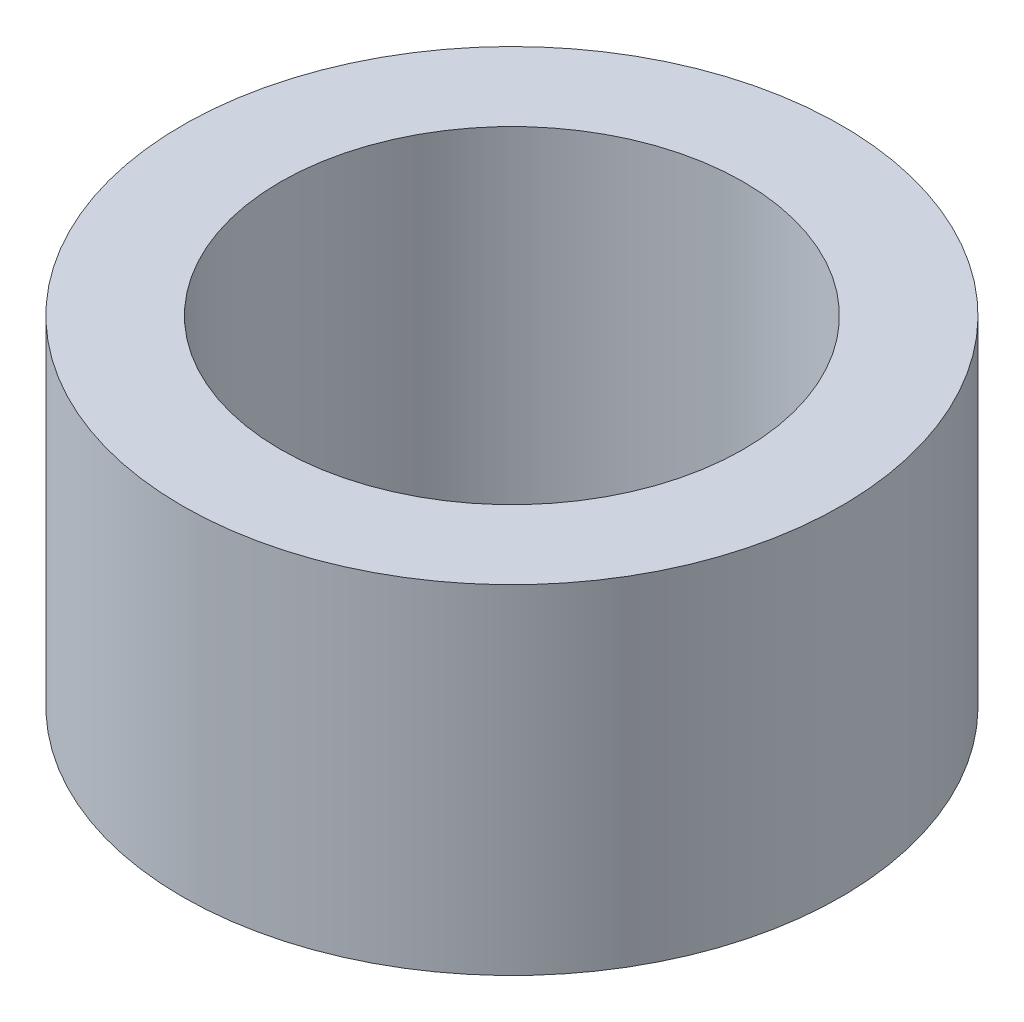
ISO-10303-21;
HEADER;
FILE_DESCRIPTION(('STEP AP214'),'2;1');
FILE_NAME('part.step','',(''),(''),'','','');
FILE_SCHEMA(('AUTOMOTIVE_DESIGN { 1 0 10303 214 1 1 1 1 }'));
ENDSEC;
DATA;
#1=APPLICATION_CONTEXT('core data for automotive mechanical design processes');
#2=APPLICATION_PROTOCOL_DEFINITION('international standard','automotive_design',2000,#1);
#3=PRODUCT_CONTEXT('',#1,'mechanical');
#4=PRODUCT('Part','Part','',(#3));
#5=PRODUCT_RELATED_PRODUCT_CATEGORY('part','',(#4));
#6=PRODUCT_DEFINITION_FORMATION('','',#4);
#7=PRODUCT_DEFINITION_CONTEXT('part definition',#1,'design');
#8=PRODUCT_DEFINITION('design','',#6,#7);
#9=PRODUCT_DEFINITION_SHAPE('','',#8);
#10=(LENGTH_UNIT() NAMED_UNIT(*) SI_UNIT(.MILLI.,.METRE.));
#11=(NAMED_UNIT(*) PLANE_ANGLE_UNIT() SI_UNIT($,.RADIAN.));
#12=(NAMED_UNIT(*) SI_UNIT($,.STERADIAN.) SOLID_ANGLE_UNIT());
#13=UNCERTAINTY_MEASURE_WITH_UNIT(LENGTH_MEASURE(1.E-05),#10,'distance_accuracy_value','');
#14=(GEOMETRIC_REPRESENTATION_CONTEXT(3) GLOBAL_UNCERTAINTY_ASSIGNED_CONTEXT((#13)) GLOBAL_UNIT_ASSIGNED_CONTEXT((#10,
#11,#12)) REPRESENTATION_CONTEXT('',''));
#15=CARTESIAN_POINT('',(0.,0.,0.));
#16=DIRECTION('',(0.,0.,1.));
#17=DIRECTION('',(1.,0.,0.));
#18=AXIS2_PLACEMENT_3D('',#15,#16,#17);
#19=CARTESIAN_POINT('',(0.,4.826,0.));
#20=DIRECTION('',(0.,1.,0.));
#21=DIRECTION('',(0.,0.,1.));
#22=AXIS2_PLACEMENT_3D('',#19,#20,#21);
#23=PLANE('',#22);
#24=CARTESIAN_POINT('',(0.,4.826,0.));
#25=DIRECTION('',(0.,1.,0.));
#26=DIRECTION('',(0.,0.,1.));
#27=AXIS2_PLACEMENT_3D('',#24,#25,#26);
#28=CIRCLE('',#27,4.699);
#29=CARTESIAN_POINT('',(0.,4.826,4.699));
#30=VERTEX_POINT('',#29);
#31=EDGE_CURVE('E12',#30,#30,#28,.T.);
#32=ORIENTED_EDGE('',*,*,#31,.T.);
#33=EDGE_LOOP('',(#32));
#34=FACE_BOUND('',#33,.T.);
#35=CARTESIAN_POINT('',(0.,4.826,0.));
#36=DIRECTION('',(0.,1.,0.));
#37=DIRECTION('',(0.,0.,1.));
#38=AXIS2_PLACEMENT_3D('',#35,#36,#37);
#39=CIRCLE('',#38,3.302);
#40=CARTESIAN_POINT('',(0.,4.826,3.302));
#41=VERTEX_POINT('',#40);
#42=EDGE_CURVE('E53',#41,#41,#39,.T.);
#43=ORIENTED_EDGE('',*,*,#42,.F.);
#44=EDGE_LOOP('',(#43));
#45=FACE_BOUND('',#44,.T.);
#46=ADVANCED_FACE('F42',(#34,#45),#23,.T.);
#47=CARTESIAN_POINT('',(0.,0.,0.));
#48=DIRECTION('',(0.,1.,0.));
#49=DIRECTION('',(0.,0.,1.));
#50=AXIS2_PLACEMENT_3D('',#47,#48,#49);
#51=PLANE('',#50);
#52=CARTESIAN_POINT('',(0.,0.,0.));
#53=DIRECTION('',(0.,1.,0.));
#54=DIRECTION('',(0.,0.,1.));
#55=AXIS2_PLACEMENT_3D('',#52,#53,#54);
#56=CIRCLE('',#55,4.699);
#57=CARTESIAN_POINT('',(0.,0.,4.699));
#58=VERTEX_POINT('',#57);
#59=EDGE_CURVE('E46',#58,#58,#56,.T.);
#60=ORIENTED_EDGE('',*,*,#59,.F.);
#61=EDGE_LOOP('',(#60));
#62=FACE_BOUND('',#61,.T.);
#63=CARTESIAN_POINT('',(0.,0.,0.));
#64=DIRECTION('',(0.,1.,0.));
#65=DIRECTION('',(0.,0.,1.));
#66=AXIS2_PLACEMENT_3D('',#63,#64,#65);
#67=CIRCLE('',#66,3.302);
#68=CARTESIAN_POINT('',(0.,0.,3.302));
#69=VERTEX_POINT('',#68);
#70=EDGE_CURVE('E55',#69,#69,#67,.T.);
#71=ORIENTED_EDGE('',*,*,#70,.T.);
#72=EDGE_LOOP('',(#71));
#73=FACE_BOUND('',#72,.T.);
#74=ADVANCED_FACE('F65',(#62,#73),#51,.F.);
#75=CARTESIAN_POINT('',(0.,4.826,0.));
#76=DIRECTION('',(0.,-1.,0.));
#77=DIRECTION('',(0.,0.,-1.));
#78=AXIS2_PLACEMENT_3D('',#75,#76,#77);
#79=CYLINDRICAL_SURFACE('',#78,4.699);
#80=ORIENTED_EDGE('',*,*,#31,.F.);
#81=EDGE_LOOP('',(#80));
#82=FACE_BOUND('',#81,.T.);
#83=ORIENTED_EDGE('',*,*,#59,.T.);
#84=EDGE_LOOP('',(#83));
#85=FACE_BOUND('',#84,.T.);
#86=ADVANCED_FACE('F44',(#82,#85),#79,.T.);
#87=CARTESIAN_POINT('',(0.,4.826,0.));
#88=DIRECTION('',(0.,-1.,0.));
#89=DIRECTION('',(0.,0.,-1.));
#90=AXIS2_PLACEMENT_3D('',#87,#88,#89);
#91=CYLINDRICAL_SURFACE('',#90,3.302);
#92=ORIENTED_EDGE('',*,*,#42,.T.);
#93=EDGE_LOOP('',(#92));
#94=FACE_BOUND('',#93,.T.);
#95=ORIENTED_EDGE('',*,*,#70,.F.);
#96=EDGE_LOOP('',(#95));
#97=FACE_BOUND('',#96,.T.);
#98=ADVANCED_FACE('F61',(#94,#97),#91,.F.);
#99=CLOSED_SHELL('',(#46,#74,#86,#98));
#100=MANIFOLD_SOLID_BREP('B2',#99);
#101=ADVANCED_BREP_SHAPE_REPRESENTATION('',(#18,#100),#14);
#102=SHAPE_DEFINITION_REPRESENTATION(#9,#101);
ENDSEC;
END-ISO-10303-21;
